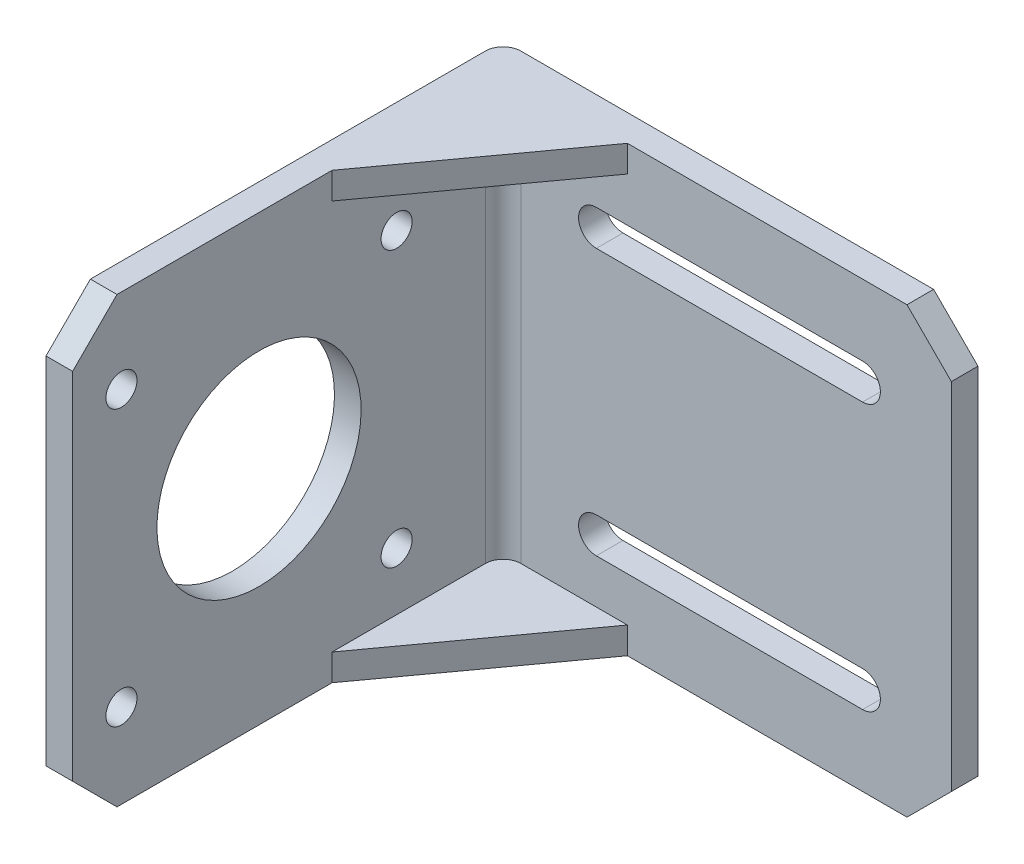
ISO-10303-21;
HEADER;
FILE_DESCRIPTION(('STEP AP214'),'2;1');
FILE_NAME('part.step','',(''),(''),'','','');
FILE_SCHEMA(('AUTOMOTIVE_DESIGN { 1 0 10303 214 1 1 1 1 }'));
ENDSEC;
DATA;
#1=APPLICATION_CONTEXT('core data for automotive mechanical design processes');
#2=APPLICATION_PROTOCOL_DEFINITION('international standard','automotive_design',2000,#1);
#3=PRODUCT_CONTEXT('',#1,'mechanical');
#4=PRODUCT('Part','Part','',(#3));
#5=PRODUCT_RELATED_PRODUCT_CATEGORY('part','',(#4));
#6=PRODUCT_DEFINITION_FORMATION('','',#4);
#7=PRODUCT_DEFINITION_CONTEXT('part definition',#1,'design');
#8=PRODUCT_DEFINITION('design','',#6,#7);
#9=PRODUCT_DEFINITION_SHAPE('','',#8);
#10=(LENGTH_UNIT() NAMED_UNIT(*) SI_UNIT(.MILLI.,.METRE.));
#11=(NAMED_UNIT(*) PLANE_ANGLE_UNIT() SI_UNIT($,.RADIAN.));
#12=(NAMED_UNIT(*) SI_UNIT($,.STERADIAN.) SOLID_ANGLE_UNIT());
#13=UNCERTAINTY_MEASURE_WITH_UNIT(LENGTH_MEASURE(1.E-05),#10,'distance_accuracy_value','');
#14=(GEOMETRIC_REPRESENTATION_CONTEXT(3) GLOBAL_UNCERTAINTY_ASSIGNED_CONTEXT((#13)) GLOBAL_UNIT_ASSIGNED_CONTEXT((#10,
#11,#12)) REPRESENTATION_CONTEXT('',''));
#15=CARTESIAN_POINT('',(0.,0.,0.));
#16=DIRECTION('',(0.,0.,1.));
#17=DIRECTION('',(1.,0.,0.));
#18=AXIS2_PLACEMENT_3D('',#15,#16,#17);
#19=CARTESIAN_POINT('',(-9.75000000000003,0.,3.));
#20=DIRECTION('',(0.809016994374951,0.,0.587785252292469));
#21=DIRECTION('',(0.,1.,0.));
#22=AXIS2_PLACEMENT_3D('',#19,#20,#21);
#23=PLANE('',#22);
#24=DIRECTION('',(0.,-1.,0.));
#25=VECTOR('',#24,1.);
#26=CARTESIAN_POINT('',(-9.75000000000003,-25.,3.));
#27=LINE('',#26,#25);
#28=CARTESIAN_POINT('',(-9.75000000000002,-22.,2.99999999999999));
#29=VERTEX_POINT('',#28);
#30=CARTESIAN_POINT('',(-9.75000000000001,-25.,3.));
#31=VERTEX_POINT('',#30);
#32=EDGE_CURVE('E333',#29,#31,#27,.T.);
#33=ORIENTED_EDGE('',*,*,#32,.F.);
#34=DIRECTION('',(0.587785252292469,0.,-0.809016994374951));
#35=VECTOR('',#34,1.);
#36=CARTESIAN_POINT('',(-9.75000000000003,-22.,3.));
#37=LINE('',#36,#35);
#38=CARTESIAN_POINT('',(-23.75,-22.,22.2693468865966));
#39=VERTEX_POINT('',#38);
#40=EDGE_CURVE('E349',#29,#39,#37,.F.);
#41=ORIENTED_EDGE('',*,*,#40,.T.);
#42=DIRECTION('',(0.,1.,0.));
#43=VECTOR('',#42,1.);
#44=CARTESIAN_POINT('',(-23.75,25.,22.2693468865966));
#45=LINE('',#44,#43);
#46=CARTESIAN_POINT('',(-23.75,-25.,22.2693468865966));
#47=VERTEX_POINT('',#46);
#48=EDGE_CURVE('E338',#47,#39,#45,.T.);
#49=ORIENTED_EDGE('',*,*,#48,.F.);
#50=DIRECTION('',(0.587785252292469,0.,-0.809016994374951));
#51=VECTOR('',#50,1.);
#52=CARTESIAN_POINT('',(-38.6864760679703,-25.,42.8276425021015));
#53=LINE('',#52,#51);
#54=EDGE_CURVE('E341',#31,#47,#53,.F.);
#55=ORIENTED_EDGE('',*,*,#54,.F.);
#56=EDGE_LOOP('',(#33,#41,#49,#55));
#57=FACE_BOUND('',#56,.T.);
#58=ADVANCED_FACE('F36',(#57),#23,.T.);
#59=CARTESIAN_POINT('',(26.75,25.,51.5));
#60=DIRECTION('',(-1.,0.,0.));
#61=DIRECTION('',(0.,-1.,0.));
#62=AXIS2_PLACEMENT_3D('',#59,#60,#61);
#63=PLANE('',#62);
#64=DIRECTION('',(0.,1.,0.));
#65=VECTOR('',#64,1.);
#66=CARTESIAN_POINT('',(26.75,25.,3.));
#67=LINE('',#66,#65);
#68=CARTESIAN_POINT('',(26.75,-20.,3.));
#69=VERTEX_POINT('',#68);
#70=CARTESIAN_POINT('',(26.75,20.,3.));
#71=VERTEX_POINT('',#70);
#72=EDGE_CURVE('E302',#69,#71,#67,.T.);
#73=ORIENTED_EDGE('',*,*,#72,.F.);
#74=DIRECTION('',(0.,0.,-1.));
#75=VECTOR('',#74,1.);
#76=CARTESIAN_POINT('',(26.75,-20.,51.5));
#77=LINE('',#76,#75);
#78=CARTESIAN_POINT('',(26.75,-20.,0.));
#79=VERTEX_POINT('',#78);
#80=EDGE_CURVE('E364',#69,#79,#77,.T.);
#81=ORIENTED_EDGE('',*,*,#80,.T.);
#82=DIRECTION('',(0.,1.,0.));
#83=VECTOR('',#82,1.);
#84=CARTESIAN_POINT('',(26.75,25.,0.));
#85=LINE('',#84,#83);
#86=CARTESIAN_POINT('',(26.75,20.,0.));
#87=VERTEX_POINT('',#86);
#88=EDGE_CURVE('E316',#79,#87,#85,.T.);
#89=ORIENTED_EDGE('',*,*,#88,.T.);
#90=DIRECTION('',(0.,0.,1.));
#91=VECTOR('',#90,1.);
#92=CARTESIAN_POINT('',(26.75,20.,51.5));
#93=LINE('',#92,#91);
#94=EDGE_CURVE('E352',#87,#71,#93,.T.);
#95=ORIENTED_EDGE('',*,*,#94,.T.);
#96=EDGE_LOOP('',(#73,#81,#89,#95));
#97=FACE_BOUND('',#96,.T.);
#98=ADVANCED_FACE('F444',(#97),#63,.F.);
#99=CARTESIAN_POINT('',(-26.75,25.,51.5));
#100=DIRECTION('',(0.,-1.,0.));
#101=DIRECTION('',(0.,0.,-1.));
#102=AXIS2_PLACEMENT_3D('',#99,#100,#101);
#103=PLANE('',#102);
#104=DIRECTION('',(-1.,0.,0.));
#105=VECTOR('',#104,1.);
#106=CARTESIAN_POINT('',(-26.75,25.,0.));
#107=LINE('',#106,#105);
#108=CARTESIAN_POINT('',(21.75,25.,0.));
#109=VERTEX_POINT('',#108);
#110=CARTESIAN_POINT('',(-24.75,25.,0.));
#111=VERTEX_POINT('',#110);
#112=EDGE_CURVE('E326',#109,#111,#107,.T.);
#113=ORIENTED_EDGE('',*,*,#112,.T.);
#114=CARTESIAN_POINT('',(-24.75,25.,2.));
#115=DIRECTION('',(0.,-1.,0.));
#116=DIRECTION('',(0.,0.,-1.));
#117=AXIS2_PLACEMENT_3D('',#114,#115,#116);
#118=CIRCLE('',#117,2.);
#119=CARTESIAN_POINT('',(-26.75,25.,2.));
#120=VERTEX_POINT('',#119);
#121=EDGE_CURVE('E11',#111,#120,#118,.F.);
#122=ORIENTED_EDGE('',*,*,#121,.T.);
#123=DIRECTION('',(0.,0.,-1.));
#124=VECTOR('',#123,1.);
#125=CARTESIAN_POINT('',(-26.75,25.,51.5));
#126=LINE('',#125,#124);
#127=CARTESIAN_POINT('',(-26.75,25.,46.5));
#128=VERTEX_POINT('',#127);
#129=EDGE_CURVE('E330',#128,#120,#126,.T.);
#130=ORIENTED_EDGE('',*,*,#129,.F.);
#131=DIRECTION('',(1.,0.,0.));
#132=VECTOR('',#131,1.);
#133=CARTESIAN_POINT('',(-23.75,25.,46.5));
#134=LINE('',#133,#132);
#135=CARTESIAN_POINT('',(-23.75,25.,46.5));
#136=VERTEX_POINT('',#135);
#137=EDGE_CURVE('E380',#128,#136,#134,.T.);
#138=ORIENTED_EDGE('',*,*,#137,.T.);
#139=DIRECTION('',(0.,0.,1.));
#140=VECTOR('',#139,1.);
#141=CARTESIAN_POINT('',(-23.75,25.,3.));
#142=LINE('',#141,#140);
#143=CARTESIAN_POINT('',(-23.75,25.,22.2693468865966));
#144=VERTEX_POINT('',#143);
#145=EDGE_CURVE('E310',#144,#136,#142,.T.);
#146=ORIENTED_EDGE('',*,*,#145,.F.);
#147=DIRECTION('',(-0.587785252292469,0.,0.809016994374951));
#148=VECTOR('',#147,1.);
#149=CARTESIAN_POINT('',(-38.6864760679703,25.,42.8276425021015));
#150=LINE('',#149,#148);
#151=CARTESIAN_POINT('',(-9.75000000000003,25.,3.));
#152=VERTEX_POINT('',#151);
#153=EDGE_CURVE('E343',#144,#152,#150,.F.);
#154=ORIENTED_EDGE('',*,*,#153,.T.);
#155=DIRECTION('',(-1.,0.,0.));
#156=VECTOR('',#155,1.);
#157=CARTESIAN_POINT('',(26.75,25.,3.));
#158=LINE('',#157,#156);
#159=CARTESIAN_POINT('',(21.75,25.,3.));
#160=VERTEX_POINT('',#159);
#161=EDGE_CURVE('E305',#160,#152,#158,.T.);
#162=ORIENTED_EDGE('',*,*,#161,.F.);
#163=DIRECTION('',(0.,0.,-1.));
#164=VECTOR('',#163,1.);
#165=CARTESIAN_POINT('',(21.75,25.,51.5));
#166=LINE('',#165,#164);
#167=EDGE_CURVE('E382',#160,#109,#166,.T.);
#168=ORIENTED_EDGE('',*,*,#167,.T.);
#169=EDGE_LOOP('',(#113,#122,#130,#138,#146,#154,#162,#168));
#170=FACE_BOUND('',#169,.T.);
#171=ADVANCED_FACE('F435',(#170),#103,.F.);
#172=CARTESIAN_POINT('',(-26.75,25.,51.5));
#173=DIRECTION('',(1.,0.,0.));
#174=DIRECTION('',(0.,1.,0.));
#175=AXIS2_PLACEMENT_3D('',#172,#173,#174);
#176=PLANE('',#175);
#177=CARTESIAN_POINT('',(-26.75,0.,30.5));
#178=DIRECTION('',(-1.,0.,0.));
#179=DIRECTION('',(0.,-1.,0.));
#180=AXIS2_PLACEMENT_3D('',#177,#178,#179);
#181=CIRCLE('',#180,11.5);
#182=CARTESIAN_POINT('',(-26.75,-11.5,30.5));
#183=VERTEX_POINT('',#182);
#184=EDGE_CURVE('E272',#183,#183,#181,.T.);
#185=ORIENTED_EDGE('',*,*,#184,.F.);
#186=EDGE_LOOP('',(#185));
#187=FACE_BOUND('',#186,.T.);
#188=CARTESIAN_POINT('',(-26.75,-15.5,15.));
#189=DIRECTION('',(-1.,0.,0.));
#190=DIRECTION('',(0.,-1.,0.));
#191=AXIS2_PLACEMENT_3D('',#188,#189,#190);
#192=CIRCLE('',#191,1.75);
#193=CARTESIAN_POINT('',(-26.75,-17.25,15.));
#194=VERTEX_POINT('',#193);
#195=EDGE_CURVE('E276',#194,#194,#192,.T.);
#196=ORIENTED_EDGE('',*,*,#195,.F.);
#197=EDGE_LOOP('',(#196));
#198=FACE_BOUND('',#197,.T.);
#199=CARTESIAN_POINT('',(-26.75,15.5,15.));
#200=DIRECTION('',(-1.,0.,0.));
#201=DIRECTION('',(0.,-1.,0.));
#202=AXIS2_PLACEMENT_3D('',#199,#200,#201);
#203=CIRCLE('',#202,1.75);
#204=CARTESIAN_POINT('',(-26.75,13.75,15.));
#205=VERTEX_POINT('',#204);
#206=EDGE_CURVE('E280',#205,#205,#203,.T.);
#207=ORIENTED_EDGE('',*,*,#206,.F.);
#208=EDGE_LOOP('',(#207));
#209=FACE_BOUND('',#208,.T.);
#210=CARTESIAN_POINT('',(-26.75,-15.5,46.));
#211=DIRECTION('',(-1.,0.,0.));
#212=DIRECTION('',(0.,-1.,0.));
#213=AXIS2_PLACEMENT_3D('',#210,#211,#212);
#214=CIRCLE('',#213,1.75);
#215=CARTESIAN_POINT('',(-26.75,-17.25,46.));
#216=VERTEX_POINT('',#215);
#217=EDGE_CURVE('E284',#216,#216,#214,.T.);
#218=ORIENTED_EDGE('',*,*,#217,.F.);
#219=EDGE_LOOP('',(#218));
#220=FACE_BOUND('',#219,.T.);
#221=CARTESIAN_POINT('',(-26.75,15.5,46.));
#222=DIRECTION('',(-1.,0.,0.));
#223=DIRECTION('',(0.,-1.,0.));
#224=AXIS2_PLACEMENT_3D('',#221,#222,#223);
#225=CIRCLE('',#224,1.75);
#226=CARTESIAN_POINT('',(-26.75,13.75,46.));
#227=VERTEX_POINT('',#226);
#228=EDGE_CURVE('E288',#227,#227,#225,.T.);
#229=ORIENTED_EDGE('',*,*,#228,.F.);
#230=EDGE_LOOP('',(#229));
#231=FACE_BOUND('',#230,.T.);
#232=ORIENTED_EDGE('',*,*,#129,.T.);
#233=DIRECTION('',(0.,-1.,0.));
#234=VECTOR('',#233,1.);
#235=CARTESIAN_POINT('',(-26.75,25.,2.));
#236=LINE('',#235,#234);
#237=CARTESIAN_POINT('',(-26.75,-25.,2.));
#238=VERTEX_POINT('',#237);
#239=EDGE_CURVE('E408',#120,#238,#236,.T.);
#240=ORIENTED_EDGE('',*,*,#239,.T.);
#241=DIRECTION('',(0.,0.,-1.));
#242=VECTOR('',#241,1.);
#243=CARTESIAN_POINT('',(-26.75,-25.,51.5));
#244=LINE('',#243,#242);
#245=CARTESIAN_POINT('',(-26.75,-25.,46.5));
#246=VERTEX_POINT('',#245);
#247=EDGE_CURVE('E322',#246,#238,#244,.T.);
#248=ORIENTED_EDGE('',*,*,#247,.F.);
#249=DIRECTION('',(0.,0.707106781186546,0.707106781186549));
#250=VECTOR('',#249,1.);
#251=CARTESIAN_POINT('',(-26.75,-20.,51.5));
#252=LINE('',#251,#250);
#253=CARTESIAN_POINT('',(-26.75,-20.,51.5));
#254=VERTEX_POINT('',#253);
#255=EDGE_CURVE('E391',#246,#254,#252,.T.);
#256=ORIENTED_EDGE('',*,*,#255,.T.);
#257=DIRECTION('',(0.,-1.,0.));
#258=VECTOR('',#257,1.);
#259=CARTESIAN_POINT('',(-26.75,25.,51.5));
#260=LINE('',#259,#258);
#261=CARTESIAN_POINT('',(-26.75,20.,51.5));
#262=VERTEX_POINT('',#261);
#263=EDGE_CURVE('E319',#262,#254,#260,.T.);
#264=ORIENTED_EDGE('',*,*,#263,.F.);
#265=DIRECTION('',(0.,0.707106781186546,-0.707106781186549));
#266=VECTOR('',#265,1.);
#267=CARTESIAN_POINT('',(-26.75,20.,51.5));
#268=LINE('',#267,#266);
#269=EDGE_CURVE('E393',#262,#128,#268,.T.);
#270=ORIENTED_EDGE('',*,*,#269,.T.);
#271=EDGE_LOOP('',(#232,#240,#248,#256,#264,#270));
#272=FACE_BOUND('',#271,.T.);
#273=ADVANCED_FACE('F414',(#187,#198,#209,#220,#231,#272),#176,.F.);
#274=CARTESIAN_POINT('',(-26.75,-25.,51.5));
#275=DIRECTION('',(0.,1.,0.));
#276=DIRECTION('',(0.,0.,1.));
#277=AXIS2_PLACEMENT_3D('',#274,#275,#276);
#278=PLANE('',#277);
#279=ORIENTED_EDGE('',*,*,#247,.T.);
#280=CARTESIAN_POINT('',(-24.75,-25.,2.));
#281=DIRECTION('',(0.,1.,0.));
#282=DIRECTION('',(0.,0.,1.));
#283=AXIS2_PLACEMENT_3D('',#280,#281,#282);
#284=CIRCLE('',#283,2.);
#285=CARTESIAN_POINT('',(-24.75,-25.,0.));
#286=VERTEX_POINT('',#285);
#287=EDGE_CURVE('E58',#238,#286,#284,.F.);
#288=ORIENTED_EDGE('',*,*,#287,.T.);
#289=DIRECTION('',(1.,0.,0.));
#290=VECTOR('',#289,1.);
#291=CARTESIAN_POINT('',(-26.75,-25.,0.));
#292=LINE('',#291,#290);
#293=CARTESIAN_POINT('',(21.7499999999999,-25.,0.));
#294=VERTEX_POINT('',#293);
#295=EDGE_CURVE('E323',#286,#294,#292,.T.);
#296=ORIENTED_EDGE('',*,*,#295,.T.);
#297=DIRECTION('',(0.,0.,1.));
#298=VECTOR('',#297,1.);
#299=CARTESIAN_POINT('',(21.7499999999999,-25.,51.5));
#300=LINE('',#299,#298);
#301=CARTESIAN_POINT('',(21.7499999999999,-25.,3.));
#302=VERTEX_POINT('',#301);
#303=EDGE_CURVE('E374',#294,#302,#300,.T.);
#304=ORIENTED_EDGE('',*,*,#303,.T.);
#305=DIRECTION('',(1.,0.,0.));
#306=VECTOR('',#305,1.);
#307=CARTESIAN_POINT('',(26.75,-25.,3.));
#308=LINE('',#307,#306);
#309=EDGE_CURVE('E307',#31,#302,#308,.T.);
#310=ORIENTED_EDGE('',*,*,#309,.F.);
#311=ORIENTED_EDGE('',*,*,#54,.T.);
#312=DIRECTION('',(0.,0.,1.));
#313=VECTOR('',#312,1.);
#314=CARTESIAN_POINT('',(-23.75,-25.,3.));
#315=LINE('',#314,#313);
#316=CARTESIAN_POINT('',(-23.75,-25.,46.4999999999999));
#317=VERTEX_POINT('',#316);
#318=EDGE_CURVE('E313',#47,#317,#315,.T.);
#319=ORIENTED_EDGE('',*,*,#318,.T.);
#320=DIRECTION('',(-1.,0.,0.));
#321=VECTOR('',#320,1.);
#322=CARTESIAN_POINT('',(-26.75,-25.,46.5));
#323=LINE('',#322,#321);
#324=EDGE_CURVE('E372',#317,#246,#323,.T.);
#325=ORIENTED_EDGE('',*,*,#324,.T.);
#326=EDGE_LOOP('',(#279,#288,#296,#304,#310,#311,#319,#325));
#327=FACE_BOUND('',#326,.T.);
#328=ADVANCED_FACE('F419',(#327),#278,.F.);
#329=CARTESIAN_POINT('',(0.,0.,51.5));
#330=DIRECTION('',(0.,0.,1.));
#331=DIRECTION('',(1.,0.,0.));
#332=AXIS2_PLACEMENT_3D('',#329,#330,#331);
#333=PLANE('',#332);
#334=DIRECTION('',(0.,-1.,0.));
#335=VECTOR('',#334,1.);
#336=CARTESIAN_POINT('',(-23.75,25.,51.5));
#337=LINE('',#336,#335);
#338=CARTESIAN_POINT('',(-23.75,20.,51.5));
#339=VERTEX_POINT('',#338);
#340=CARTESIAN_POINT('',(-23.75,-20.,51.5));
#341=VERTEX_POINT('',#340);
#342=EDGE_CURVE('E300',#339,#341,#337,.T.);
#343=ORIENTED_EDGE('',*,*,#342,.F.);
#344=DIRECTION('',(-1.,0.,0.));
#345=VECTOR('',#344,1.);
#346=CARTESIAN_POINT('',(-26.75,20.,51.5));
#347=LINE('',#346,#345);
#348=EDGE_CURVE('E388',#339,#262,#347,.T.);
#349=ORIENTED_EDGE('',*,*,#348,.T.);
#350=ORIENTED_EDGE('',*,*,#263,.T.);
#351=DIRECTION('',(1.,0.,0.));
#352=VECTOR('',#351,1.);
#353=CARTESIAN_POINT('',(-23.75,-20.,51.5));
#354=LINE('',#353,#352);
#355=EDGE_CURVE('E385',#254,#341,#354,.T.);
#356=ORIENTED_EDGE('',*,*,#355,.T.);
#357=EDGE_LOOP('',(#343,#349,#350,#356));
#358=FACE_BOUND('',#357,.T.);
#359=ADVANCED_FACE('F428',(#358),#333,.T.);
#360=CARTESIAN_POINT('',(0.,0.,0.));
#361=DIRECTION('',(0.,0.,1.));
#362=DIRECTION('',(1.,0.,0.));
#363=AXIS2_PLACEMENT_3D('',#360,#361,#362);
#364=PLANE('',#363);
#365=DIRECTION('',(-1.,0.,0.));
#366=VECTOR('',#365,1.);
#367=CARTESIAN_POINT('',(0.,-13.,0.));
#368=LINE('',#367,#366);
#369=CARTESIAN_POINT('',(16.75,-13.,0.));
#370=VERTEX_POINT('',#369);
#371=CARTESIAN_POINT('',(-13.25,-13.,0.));
#372=VERTEX_POINT('',#371);
#373=EDGE_CURVE('E234',#370,#372,#368,.T.);
#374=ORIENTED_EDGE('',*,*,#373,.T.);
#375=CARTESIAN_POINT('',(-13.25,-15.,0.));
#376=DIRECTION('',(0.,0.,1.));
#377=DIRECTION('',(1.,0.,0.));
#378=AXIS2_PLACEMENT_3D('',#375,#376,#377);
#379=CIRCLE('',#378,2.);
#380=CARTESIAN_POINT('',(-13.25,-17.,0.));
#381=VERTEX_POINT('',#380);
#382=EDGE_CURVE('E237',#372,#381,#379,.T.);
#383=ORIENTED_EDGE('',*,*,#382,.T.);
#384=DIRECTION('',(1.,0.,0.));
#385=VECTOR('',#384,1.);
#386=CARTESIAN_POINT('',(0.,-17.,0.));
#387=LINE('',#386,#385);
#388=CARTESIAN_POINT('',(16.75,-17.,0.));
#389=VERTEX_POINT('',#388);
#390=EDGE_CURVE('E229',#381,#389,#387,.T.);
#391=ORIENTED_EDGE('',*,*,#390,.T.);
#392=CARTESIAN_POINT('',(16.75,-15.,0.));
#393=DIRECTION('',(0.,0.,1.));
#394=DIRECTION('',(1.,0.,0.));
#395=AXIS2_PLACEMENT_3D('',#392,#393,#394);
#396=CIRCLE('',#395,2.);
#397=EDGE_CURVE('E204',#389,#370,#396,.T.);
#398=ORIENTED_EDGE('',*,*,#397,.T.);
#399=EDGE_LOOP('',(#374,#383,#391,#398));
#400=FACE_BOUND('',#399,.T.);
#401=DIRECTION('',(-1.,0.,0.));
#402=VECTOR('',#401,1.);
#403=CARTESIAN_POINT('',(0.,17.,0.));
#404=LINE('',#403,#402);
#405=CARTESIAN_POINT('',(16.75,17.,0.));
#406=VERTEX_POINT('',#405);
#407=CARTESIAN_POINT('',(-13.25,17.,0.));
#408=VERTEX_POINT('',#407);
#409=EDGE_CURVE('E266',#406,#408,#404,.T.);
#410=ORIENTED_EDGE('',*,*,#409,.T.);
#411=CARTESIAN_POINT('',(-13.25,15.,0.));
#412=DIRECTION('',(0.,0.,1.));
#413=DIRECTION('',(1.,0.,0.));
#414=AXIS2_PLACEMENT_3D('',#411,#412,#413);
#415=CIRCLE('',#414,2.);
#416=CARTESIAN_POINT('',(-13.25,13.,0.));
#417=VERTEX_POINT('',#416);
#418=EDGE_CURVE('E269',#408,#417,#415,.T.);
#419=ORIENTED_EDGE('',*,*,#418,.T.);
#420=DIRECTION('',(1.,0.,0.));
#421=VECTOR('',#420,1.);
#422=CARTESIAN_POINT('',(0.,13.,0.));
#423=LINE('',#422,#421);
#424=CARTESIAN_POINT('',(16.75,13.,0.));
#425=VERTEX_POINT('',#424);
#426=EDGE_CURVE('E254',#417,#425,#423,.T.);
#427=ORIENTED_EDGE('',*,*,#426,.T.);
#428=CARTESIAN_POINT('',(16.75,15.,0.));
#429=DIRECTION('',(0.,0.,1.));
#430=DIRECTION('',(1.,0.,0.));
#431=AXIS2_PLACEMENT_3D('',#428,#429,#430);
#432=CIRCLE('',#431,2.);
#433=EDGE_CURVE('E263',#425,#406,#432,.T.);
#434=ORIENTED_EDGE('',*,*,#433,.T.);
#435=EDGE_LOOP('',(#410,#419,#427,#434));
#436=FACE_BOUND('',#435,.T.);
#437=ORIENTED_EDGE('',*,*,#295,.F.);
#438=DIRECTION('',(0.,-1.,0.));
#439=VECTOR('',#438,1.);
#440=CARTESIAN_POINT('',(-24.75,0.,0.));
#441=LINE('',#440,#439);
#442=EDGE_CURVE('E44',#286,#111,#441,.F.);
#443=ORIENTED_EDGE('',*,*,#442,.T.);
#444=ORIENTED_EDGE('',*,*,#112,.F.);
#445=DIRECTION('',(-0.707106781186546,0.707106781186549,0.));
#446=VECTOR('',#445,1.);
#447=CARTESIAN_POINT('',(21.75,25.,0.));
#448=LINE('',#447,#446);
#449=EDGE_CURVE('E367',#109,#87,#448,.F.);
#450=ORIENTED_EDGE('',*,*,#449,.T.);
#451=ORIENTED_EDGE('',*,*,#88,.F.);
#452=DIRECTION('',(0.707106781186549,0.707106781186546,0.));
#453=VECTOR('',#452,1.);
#454=CARTESIAN_POINT('',(26.75,-20.,0.));
#455=LINE('',#454,#453);
#456=EDGE_CURVE('E369',#79,#294,#455,.F.);
#457=ORIENTED_EDGE('',*,*,#456,.T.);
#458=EDGE_LOOP('',(#437,#443,#444,#450,#451,#457));
#459=FACE_BOUND('',#458,.T.);
#460=ADVANCED_FACE('F483',(#400,#436,#459),#364,.F.);
#461=CARTESIAN_POINT('',(-23.75,25.,3.));
#462=DIRECTION('',(-1.,0.,0.));
#463=DIRECTION('',(0.,-1.,0.));
#464=AXIS2_PLACEMENT_3D('',#461,#462,#463);
#465=PLANE('',#464);
#466=CARTESIAN_POINT('',(-23.75,0.,30.5));
#467=DIRECTION('',(-1.,0.,0.));
#468=DIRECTION('',(0.,-1.,0.));
#469=AXIS2_PLACEMENT_3D('',#466,#467,#468);
#470=CIRCLE('',#469,11.5);
#471=CARTESIAN_POINT('',(-23.75,-11.5,30.5));
#472=VERTEX_POINT('',#471);
#473=EDGE_CURVE('E275',#472,#472,#470,.T.);
#474=ORIENTED_EDGE('',*,*,#473,.T.);
#475=EDGE_LOOP('',(#474));
#476=FACE_BOUND('',#475,.T.);
#477=CARTESIAN_POINT('',(-23.75,-15.5,15.));
#478=DIRECTION('',(-1.,0.,0.));
#479=DIRECTION('',(0.,-1.,0.));
#480=AXIS2_PLACEMENT_3D('',#477,#478,#479);
#481=CIRCLE('',#480,1.75);
#482=CARTESIAN_POINT('',(-23.75,-17.25,15.));
#483=VERTEX_POINT('',#482);
#484=EDGE_CURVE('E279',#483,#483,#481,.T.);
#485=ORIENTED_EDGE('',*,*,#484,.T.);
#486=EDGE_LOOP('',(#485));
#487=FACE_BOUND('',#486,.T.);
#488=CARTESIAN_POINT('',(-23.75,15.5,15.));
#489=DIRECTION('',(-1.,0.,0.));
#490=DIRECTION('',(0.,-1.,0.));
#491=AXIS2_PLACEMENT_3D('',#488,#489,#490);
#492=CIRCLE('',#491,1.75);
#493=CARTESIAN_POINT('',(-23.75,13.75,15.));
#494=VERTEX_POINT('',#493);
#495=EDGE_CURVE('E283',#494,#494,#492,.T.);
#496=ORIENTED_EDGE('',*,*,#495,.T.);
#497=EDGE_LOOP('',(#496));
#498=FACE_BOUND('',#497,.T.);
#499=CARTESIAN_POINT('',(-23.75,-15.5,46.));
#500=DIRECTION('',(-1.,0.,0.));
#501=DIRECTION('',(0.,-1.,0.));
#502=AXIS2_PLACEMENT_3D('',#499,#500,#501);
#503=CIRCLE('',#502,1.75);
#504=CARTESIAN_POINT('',(-23.75,-17.25,46.));
#505=VERTEX_POINT('',#504);
#506=EDGE_CURVE('E287',#505,#505,#503,.T.);
#507=ORIENTED_EDGE('',*,*,#506,.T.);
#508=EDGE_LOOP('',(#507));
#509=FACE_BOUND('',#508,.T.);
#510=CARTESIAN_POINT('',(-23.75,15.5,46.));
#511=DIRECTION('',(-1.,0.,0.));
#512=DIRECTION('',(0.,-1.,0.));
#513=AXIS2_PLACEMENT_3D('',#510,#511,#512);
#514=CIRCLE('',#513,1.75);
#515=CARTESIAN_POINT('',(-23.75,13.75,46.));
#516=VERTEX_POINT('',#515);
#517=EDGE_CURVE('E291',#516,#516,#514,.T.);
#518=ORIENTED_EDGE('',*,*,#517,.T.);
#519=EDGE_LOOP('',(#518));
#520=FACE_BOUND('',#519,.T.);
#521=DIRECTION('',(0.,0.,-1.));
#522=VECTOR('',#521,1.);
#523=CARTESIAN_POINT('',(-23.75,-22.,2.99999999999999));
#524=LINE('',#523,#522);
#525=CARTESIAN_POINT('',(-23.75,-22.,5.));
#526=VERTEX_POINT('',#525);
#527=EDGE_CURVE('E294',#39,#526,#524,.T.);
#528=ORIENTED_EDGE('',*,*,#527,.T.);
#529=DIRECTION('',(0.,1.,0.));
#530=VECTOR('',#529,1.);
#531=CARTESIAN_POINT('',(-23.75,22.,5.));
#532=LINE('',#531,#530);
#533=CARTESIAN_POINT('',(-23.75,22.,4.99999999999999));
#534=VERTEX_POINT('',#533);
#535=EDGE_CURVE('E399',#526,#534,#532,.T.);
#536=ORIENTED_EDGE('',*,*,#535,.T.);
#537=DIRECTION('',(0.,0.,1.));
#538=VECTOR('',#537,1.);
#539=CARTESIAN_POINT('',(-23.75,22.,3.));
#540=LINE('',#539,#538);
#541=CARTESIAN_POINT('',(-23.75,22.,22.2693468865966));
#542=VERTEX_POINT('',#541);
#543=EDGE_CURVE('E292',#534,#542,#540,.T.);
#544=ORIENTED_EDGE('',*,*,#543,.T.);
#545=EDGE_CURVE('E337',#542,#144,#45,.T.);
#546=ORIENTED_EDGE('',*,*,#545,.T.);
#547=ORIENTED_EDGE('',*,*,#145,.T.);
#548=DIRECTION('',(0.,-0.707106781186546,0.707106781186549));
#549=VECTOR('',#548,1.);
#550=CARTESIAN_POINT('',(-23.75,20.,51.5));
#551=LINE('',#550,#549);
#552=EDGE_CURVE('E397',#136,#339,#551,.T.);
#553=ORIENTED_EDGE('',*,*,#552,.T.);
#554=ORIENTED_EDGE('',*,*,#342,.T.);
#555=DIRECTION('',(0.,-0.707106781186546,-0.707106781186549));
#556=VECTOR('',#555,1.);
#557=CARTESIAN_POINT('',(-23.75,-20.,51.5));
#558=LINE('',#557,#556);
#559=EDGE_CURVE('E395',#341,#317,#558,.T.);
#560=ORIENTED_EDGE('',*,*,#559,.T.);
#561=ORIENTED_EDGE('',*,*,#318,.F.);
#562=ORIENTED_EDGE('',*,*,#48,.T.);
#563=EDGE_LOOP('',(#528,#536,#544,#546,#547,#553,#554,#560,#561,#562));
#564=FACE_BOUND('',#563,.T.);
#565=ADVANCED_FACE('F465',(#476,#487,#498,#509,#520,#564),#465,.F.);
#566=CARTESIAN_POINT('',(0.,0.,3.));
#567=DIRECTION('',(0.,0.,-1.));
#568=DIRECTION('',(-1.,0.,0.));
#569=AXIS2_PLACEMENT_3D('',#566,#567,#568);
#570=PLANE('',#569);
#571=DIRECTION('',(1.,0.,0.));
#572=VECTOR('',#571,1.);
#573=CARTESIAN_POINT('',(-13.25,-17.,3.));
#574=LINE('',#573,#572);
#575=CARTESIAN_POINT('',(-13.25,-17.,3.));
#576=VERTEX_POINT('',#575);
#577=CARTESIAN_POINT('',(16.75,-17.,3.));
#578=VERTEX_POINT('',#577);
#579=EDGE_CURVE('E212',#576,#578,#574,.T.);
#580=ORIENTED_EDGE('',*,*,#579,.F.);
#581=CARTESIAN_POINT('',(-13.25,-15.,3.));
#582=DIRECTION('',(0.,0.,1.));
#583=DIRECTION('',(1.,0.,0.));
#584=AXIS2_PLACEMENT_3D('',#581,#582,#583);
#585=CIRCLE('',#584,2.);
#586=CARTESIAN_POINT('',(-13.25,-13.,3.));
#587=VERTEX_POINT('',#586);
#588=EDGE_CURVE('E217',#587,#576,#585,.T.);
#589=ORIENTED_EDGE('',*,*,#588,.F.);
#590=DIRECTION('',(-1.,0.,0.));
#591=VECTOR('',#590,1.);
#592=CARTESIAN_POINT('',(-13.25,-13.,3.));
#593=LINE('',#592,#591);
#594=CARTESIAN_POINT('',(16.75,-13.,3.));
#595=VERTEX_POINT('',#594);
#596=EDGE_CURVE('E222',#595,#587,#593,.T.);
#597=ORIENTED_EDGE('',*,*,#596,.F.);
#598=CARTESIAN_POINT('',(16.75,-15.,3.));
#599=DIRECTION('',(0.,0.,1.));
#600=DIRECTION('',(1.,0.,0.));
#601=AXIS2_PLACEMENT_3D('',#598,#599,#600);
#602=CIRCLE('',#601,2.);
#603=EDGE_CURVE('E201',#578,#595,#602,.T.);
#604=ORIENTED_EDGE('',*,*,#603,.F.);
#605=EDGE_LOOP('',(#580,#589,#597,#604));
#606=FACE_BOUND('',#605,.T.);
#607=DIRECTION('',(1.,0.,0.));
#608=VECTOR('',#607,1.);
#609=CARTESIAN_POINT('',(-13.25,13.,3.));
#610=LINE('',#609,#608);
#611=CARTESIAN_POINT('',(-13.25,13.,3.));
#612=VERTEX_POINT('',#611);
#613=CARTESIAN_POINT('',(16.75,13.,3.));
#614=VERTEX_POINT('',#613);
#615=EDGE_CURVE('E242',#612,#614,#610,.T.);
#616=ORIENTED_EDGE('',*,*,#615,.F.);
#617=CARTESIAN_POINT('',(-13.25,15.,3.));
#618=DIRECTION('',(0.,0.,1.));
#619=DIRECTION('',(1.,0.,0.));
#620=AXIS2_PLACEMENT_3D('',#617,#618,#619);
#621=CIRCLE('',#620,2.);
#622=CARTESIAN_POINT('',(-13.25,17.,3.));
#623=VERTEX_POINT('',#622);
#624=EDGE_CURVE('E240',#623,#612,#621,.T.);
#625=ORIENTED_EDGE('',*,*,#624,.F.);
#626=DIRECTION('',(-1.,0.,0.));
#627=VECTOR('',#626,1.);
#628=CARTESIAN_POINT('',(-13.25,17.,3.));
#629=LINE('',#628,#627);
#630=CARTESIAN_POINT('',(16.75,17.,3.));
#631=VERTEX_POINT('',#630);
#632=EDGE_CURVE('E248',#631,#623,#629,.T.);
#633=ORIENTED_EDGE('',*,*,#632,.F.);
#634=CARTESIAN_POINT('',(16.75,15.,3.));
#635=DIRECTION('',(0.,0.,1.));
#636=DIRECTION('',(1.,0.,0.));
#637=AXIS2_PLACEMENT_3D('',#634,#635,#636);
#638=CIRCLE('',#637,2.);
#639=EDGE_CURVE('E245',#614,#631,#638,.T.);
#640=ORIENTED_EDGE('',*,*,#639,.F.);
#641=EDGE_LOOP('',(#616,#625,#633,#640));
#642=FACE_BOUND('',#641,.T.);
#643=DIRECTION('',(1.,0.,0.));
#644=VECTOR('',#643,1.);
#645=CARTESIAN_POINT('',(-23.75,22.,3.));
#646=LINE('',#645,#644);
#647=CARTESIAN_POINT('',(-21.75,22.,3.));
#648=VERTEX_POINT('',#647);
#649=CARTESIAN_POINT('',(-9.75000000000004,22.,3.));
#650=VERTEX_POINT('',#649);
#651=EDGE_CURVE('E297',#648,#650,#646,.T.);
#652=ORIENTED_EDGE('',*,*,#651,.F.);
#653=DIRECTION('',(0.,1.,0.));
#654=VECTOR('',#653,1.);
#655=CARTESIAN_POINT('',(-21.75,-22.,3.));
#656=LINE('',#655,#654);
#657=CARTESIAN_POINT('',(-21.75,-22.,2.99999999999999));
#658=VERTEX_POINT('',#657);
#659=EDGE_CURVE('E404',#648,#658,#656,.F.);
#660=ORIENTED_EDGE('',*,*,#659,.T.);
#661=DIRECTION('',(1.,0.,0.));
#662=VECTOR('',#661,1.);
#663=CARTESIAN_POINT('',(-23.75,-22.,2.99999999999999));
#664=LINE('',#663,#662);
#665=EDGE_CURVE('E298',#658,#29,#664,.T.);
#666=ORIENTED_EDGE('',*,*,#665,.T.);
#667=ORIENTED_EDGE('',*,*,#32,.T.);
#668=ORIENTED_EDGE('',*,*,#309,.T.);
#669=DIRECTION('',(-0.707106781186549,-0.707106781186546,0.));
#670=VECTOR('',#669,1.);
#671=CARTESIAN_POINT('',(26.75,-20.,3.));
#672=LINE('',#671,#670);
#673=EDGE_CURVE('E378',#302,#69,#672,.F.);
#674=ORIENTED_EDGE('',*,*,#673,.T.);
#675=ORIENTED_EDGE('',*,*,#72,.T.);
#676=DIRECTION('',(0.707106781186546,-0.707106781186549,0.));
#677=VECTOR('',#676,1.);
#678=CARTESIAN_POINT('',(21.75,25.,3.));
#679=LINE('',#678,#677);
#680=EDGE_CURVE('E376',#71,#160,#679,.F.);
#681=ORIENTED_EDGE('',*,*,#680,.T.);
#682=ORIENTED_EDGE('',*,*,#161,.T.);
#683=EDGE_CURVE('E334',#152,#650,#27,.T.);
#684=ORIENTED_EDGE('',*,*,#683,.T.);
#685=EDGE_LOOP('',(#652,#660,#666,#667,#668,#674,#675,#681,#682,#684));
#686=FACE_BOUND('',#685,.T.);
#687=ADVANCED_FACE('F219',(#606,#642,#686),#570,.F.);
#688=ORIENTED_EDGE('',*,*,#545,.F.);
#689=DIRECTION('',(-0.587785252292469,0.,0.809016994374951));
#690=VECTOR('',#689,1.);
#691=CARTESIAN_POINT('',(-9.75000000000003,22.,3.));
#692=LINE('',#691,#690);
#693=EDGE_CURVE('E346',#542,#650,#692,.F.);
#694=ORIENTED_EDGE('',*,*,#693,.T.);
#695=ORIENTED_EDGE('',*,*,#683,.F.);
#696=ORIENTED_EDGE('',*,*,#153,.F.);
#697=EDGE_LOOP('',(#688,#694,#695,#696));
#698=FACE_BOUND('',#697,.T.);
#699=ADVANCED_FACE('F447',(#698),#23,.T.);
#700=CARTESIAN_POINT('',(-23.75,-22.,2.99999999999999));
#701=DIRECTION('',(0.,-1.,0.));
#702=DIRECTION('',(0.,0.,-1.));
#703=AXIS2_PLACEMENT_3D('',#700,#701,#702);
#704=PLANE('',#703);
#705=ORIENTED_EDGE('',*,*,#665,.F.);
#706=CARTESIAN_POINT('',(-21.75,-22.,5.));
#707=DIRECTION('',(0.,-1.,0.));
#708=DIRECTION('',(0.,0.,-1.));
#709=AXIS2_PLACEMENT_3D('',#706,#707,#708);
#710=CIRCLE('',#709,2.);
#711=EDGE_CURVE('E406',#658,#526,#710,.F.);
#712=ORIENTED_EDGE('',*,*,#711,.T.);
#713=ORIENTED_EDGE('',*,*,#527,.F.);
#714=ORIENTED_EDGE('',*,*,#40,.F.);
#715=EDGE_LOOP('',(#705,#712,#713,#714));
#716=FACE_BOUND('',#715,.T.);
#717=ADVANCED_FACE('F456',(#716),#704,.F.);
#718=CARTESIAN_POINT('',(-23.75,22.,3.));
#719=DIRECTION('',(0.,1.,0.));
#720=DIRECTION('',(0.,0.,1.));
#721=AXIS2_PLACEMENT_3D('',#718,#719,#720);
#722=PLANE('',#721);
#723=ORIENTED_EDGE('',*,*,#543,.F.);
#724=CARTESIAN_POINT('',(-21.75,22.,5.));
#725=DIRECTION('',(0.,1.,0.));
#726=DIRECTION('',(0.,0.,1.));
#727=AXIS2_PLACEMENT_3D('',#724,#725,#726);
#728=CIRCLE('',#727,2.);
#729=EDGE_CURVE('E402',#534,#648,#728,.F.);
#730=ORIENTED_EDGE('',*,*,#729,.T.);
#731=ORIENTED_EDGE('',*,*,#651,.T.);
#732=ORIENTED_EDGE('',*,*,#693,.F.);
#733=EDGE_LOOP('',(#723,#730,#731,#732));
#734=FACE_BOUND('',#733,.T.);
#735=ADVANCED_FACE('F462',(#734),#722,.F.);
#736=CARTESIAN_POINT('',(-16.75,15.5,46.));
#737=DIRECTION('',(-1.,0.,0.));
#738=DIRECTION('',(0.,-1.,0.));
#739=AXIS2_PLACEMENT_3D('',#736,#737,#738);
#740=CYLINDRICAL_SURFACE('',#739,1.75);
#741=ORIENTED_EDGE('',*,*,#228,.T.);
#742=EDGE_LOOP('',(#741));
#743=FACE_BOUND('',#742,.T.);
#744=ORIENTED_EDGE('',*,*,#517,.F.);
#745=EDGE_LOOP('',(#744));
#746=FACE_BOUND('',#745,.T.);
#747=ADVANCED_FACE('F499',(#743,#746),#740,.F.);
#748=CARTESIAN_POINT('',(-16.75,-15.5,46.));
#749=DIRECTION('',(-1.,0.,0.));
#750=DIRECTION('',(0.,-1.,0.));
#751=AXIS2_PLACEMENT_3D('',#748,#749,#750);
#752=CYLINDRICAL_SURFACE('',#751,1.75);
#753=ORIENTED_EDGE('',*,*,#217,.T.);
#754=EDGE_LOOP('',(#753));
#755=FACE_BOUND('',#754,.T.);
#756=ORIENTED_EDGE('',*,*,#506,.F.);
#757=EDGE_LOOP('',(#756));
#758=FACE_BOUND('',#757,.T.);
#759=ADVANCED_FACE('F504',(#755,#758),#752,.F.);
#760=CARTESIAN_POINT('',(-16.75,15.5,15.));
#761=DIRECTION('',(-1.,0.,0.));
#762=DIRECTION('',(0.,-1.,0.));
#763=AXIS2_PLACEMENT_3D('',#760,#761,#762);
#764=CYLINDRICAL_SURFACE('',#763,1.75);
#765=ORIENTED_EDGE('',*,*,#206,.T.);
#766=EDGE_LOOP('',(#765));
#767=FACE_BOUND('',#766,.T.);
#768=ORIENTED_EDGE('',*,*,#495,.F.);
#769=EDGE_LOOP('',(#768));
#770=FACE_BOUND('',#769,.T.);
#771=ADVANCED_FACE('F672',(#767,#770),#764,.F.);
#772=CARTESIAN_POINT('',(-16.75,-15.5,15.));
#773=DIRECTION('',(-1.,0.,0.));
#774=DIRECTION('',(0.,-1.,0.));
#775=AXIS2_PLACEMENT_3D('',#772,#773,#774);
#776=CYLINDRICAL_SURFACE('',#775,1.75);
#777=ORIENTED_EDGE('',*,*,#195,.T.);
#778=EDGE_LOOP('',(#777));
#779=FACE_BOUND('',#778,.T.);
#780=ORIENTED_EDGE('',*,*,#484,.F.);
#781=EDGE_LOOP('',(#780));
#782=FACE_BOUND('',#781,.T.);
#783=ADVANCED_FACE('F664',(#779,#782),#776,.F.);
#784=CARTESIAN_POINT('',(-16.75,0.,30.5));
#785=DIRECTION('',(-1.,0.,0.));
#786=DIRECTION('',(0.,-1.,0.));
#787=AXIS2_PLACEMENT_3D('',#784,#785,#786);
#788=CYLINDRICAL_SURFACE('',#787,11.5);
#789=ORIENTED_EDGE('',*,*,#184,.T.);
#790=EDGE_LOOP('',(#789));
#791=FACE_BOUND('',#790,.T.);
#792=ORIENTED_EDGE('',*,*,#473,.F.);
#793=EDGE_LOOP('',(#792));
#794=FACE_BOUND('',#793,.T.);
#795=ADVANCED_FACE('F656',(#791,#794),#788,.F.);
#796=CARTESIAN_POINT('',(-13.25,15.,-7.));
#797=DIRECTION('',(0.,0.,1.));
#798=DIRECTION('',(1.,0.,0.));
#799=AXIS2_PLACEMENT_3D('',#796,#797,#798);
#800=CYLINDRICAL_SURFACE('',#799,2.);
#801=DIRECTION('',(0.,0.,1.));
#802=VECTOR('',#801,1.);
#803=CARTESIAN_POINT('',(-13.25,17.,-7.));
#804=LINE('',#803,#802);
#805=EDGE_CURVE('E252',#408,#623,#804,.T.);
#806=ORIENTED_EDGE('',*,*,#805,.T.);
#807=ORIENTED_EDGE('',*,*,#624,.T.);
#808=DIRECTION('',(0.,0.,1.));
#809=VECTOR('',#808,1.);
#810=CARTESIAN_POINT('',(-13.25,13.,-7.));
#811=LINE('',#810,#809);
#812=EDGE_CURVE('E251',#417,#612,#811,.T.);
#813=ORIENTED_EDGE('',*,*,#812,.F.);
#814=ORIENTED_EDGE('',*,*,#418,.F.);
#815=EDGE_LOOP('',(#806,#807,#813,#814));
#816=FACE_BOUND('',#815,.T.);
#817=ADVANCED_FACE('F648',(#816),#800,.F.);
#818=CARTESIAN_POINT('',(-13.25,17.,-7.));
#819=DIRECTION('',(0.,1.,0.));
#820=DIRECTION('',(0.,0.,1.));
#821=AXIS2_PLACEMENT_3D('',#818,#819,#820);
#822=PLANE('',#821);
#823=DIRECTION('',(0.,0.,1.));
#824=VECTOR('',#823,1.);
#825=CARTESIAN_POINT('',(16.75,17.,-7.));
#826=LINE('',#825,#824);
#827=EDGE_CURVE('E255',#406,#631,#826,.T.);
#828=ORIENTED_EDGE('',*,*,#827,.T.);
#829=ORIENTED_EDGE('',*,*,#632,.T.);
#830=ORIENTED_EDGE('',*,*,#805,.F.);
#831=ORIENTED_EDGE('',*,*,#409,.F.);
#832=EDGE_LOOP('',(#828,#829,#830,#831));
#833=FACE_BOUND('',#832,.T.);
#834=ADVANCED_FACE('F640',(#833),#822,.F.);
#835=CARTESIAN_POINT('',(16.75,15.,-7.));
#836=DIRECTION('',(0.,0.,1.));
#837=DIRECTION('',(1.,0.,0.));
#838=AXIS2_PLACEMENT_3D('',#835,#836,#837);
#839=CYLINDRICAL_SURFACE('',#838,2.);
#840=DIRECTION('',(0.,0.,1.));
#841=VECTOR('',#840,1.);
#842=CARTESIAN_POINT('',(16.75,13.,-7.));
#843=LINE('',#842,#841);
#844=EDGE_CURVE('E257',#425,#614,#843,.T.);
#845=ORIENTED_EDGE('',*,*,#844,.T.);
#846=ORIENTED_EDGE('',*,*,#639,.T.);
#847=ORIENTED_EDGE('',*,*,#827,.F.);
#848=ORIENTED_EDGE('',*,*,#433,.F.);
#849=EDGE_LOOP('',(#845,#846,#847,#848));
#850=FACE_BOUND('',#849,.T.);
#851=ADVANCED_FACE('F632',(#850),#839,.F.);
#852=CARTESIAN_POINT('',(-13.25,13.,-7.));
#853=DIRECTION('',(0.,-1.,0.));
#854=DIRECTION('',(0.,0.,-1.));
#855=AXIS2_PLACEMENT_3D('',#852,#853,#854);
#856=PLANE('',#855);
#857=ORIENTED_EDGE('',*,*,#812,.T.);
#858=ORIENTED_EDGE('',*,*,#615,.T.);
#859=ORIENTED_EDGE('',*,*,#844,.F.);
#860=ORIENTED_EDGE('',*,*,#426,.F.);
#861=EDGE_LOOP('',(#857,#858,#859,#860));
#862=FACE_BOUND('',#861,.T.);
#863=ADVANCED_FACE('F624',(#862),#856,.F.);
#864=CARTESIAN_POINT('',(-13.25,-15.,-7.));
#865=DIRECTION('',(0.,0.,1.));
#866=DIRECTION('',(1.,0.,0.));
#867=AXIS2_PLACEMENT_3D('',#864,#865,#866);
#868=CYLINDRICAL_SURFACE('',#867,2.);
#869=DIRECTION('',(0.,0.,1.));
#870=VECTOR('',#869,1.);
#871=CARTESIAN_POINT('',(-13.25,-13.,-7.));
#872=LINE('',#871,#870);
#873=EDGE_CURVE('E227',#372,#587,#872,.T.);
#874=ORIENTED_EDGE('',*,*,#873,.T.);
#875=ORIENTED_EDGE('',*,*,#588,.T.);
#876=DIRECTION('',(0.,0.,1.));
#877=VECTOR('',#876,1.);
#878=CARTESIAN_POINT('',(-13.25,-17.,-7.));
#879=LINE('',#878,#877);
#880=EDGE_CURVE('E208',#381,#576,#879,.T.);
#881=ORIENTED_EDGE('',*,*,#880,.F.);
#882=ORIENTED_EDGE('',*,*,#382,.F.);
#883=EDGE_LOOP('',(#874,#875,#881,#882));
#884=FACE_BOUND('',#883,.T.);
#885=ADVANCED_FACE('F616',(#884),#868,.F.);
#886=CARTESIAN_POINT('',(-13.25,-13.,-7.));
#887=DIRECTION('',(0.,1.,0.));
#888=DIRECTION('',(0.,0.,1.));
#889=AXIS2_PLACEMENT_3D('',#886,#887,#888);
#890=PLANE('',#889);
#891=DIRECTION('',(0.,0.,1.));
#892=VECTOR('',#891,1.);
#893=CARTESIAN_POINT('',(16.75,-13.,-7.));
#894=LINE('',#893,#892);
#895=EDGE_CURVE('E207',#370,#595,#894,.T.);
#896=ORIENTED_EDGE('',*,*,#895,.T.);
#897=ORIENTED_EDGE('',*,*,#596,.T.);
#898=ORIENTED_EDGE('',*,*,#873,.F.);
#899=ORIENTED_EDGE('',*,*,#373,.F.);
#900=EDGE_LOOP('',(#896,#897,#898,#899));
#901=FACE_BOUND('',#900,.T.);
#902=ADVANCED_FACE('F609',(#901),#890,.F.);
#903=CARTESIAN_POINT('',(16.75,-15.,-7.));
#904=DIRECTION('',(0.,0.,1.));
#905=DIRECTION('',(1.,0.,0.));
#906=AXIS2_PLACEMENT_3D('',#903,#904,#905);
#907=CYLINDRICAL_SURFACE('',#906,2.);
#908=DIRECTION('',(0.,0.,1.));
#909=VECTOR('',#908,1.);
#910=CARTESIAN_POINT('',(16.75,-17.,-7.));
#911=LINE('',#910,#909);
#912=EDGE_CURVE('E196',#389,#578,#911,.T.);
#913=ORIENTED_EDGE('',*,*,#912,.T.);
#914=ORIENTED_EDGE('',*,*,#603,.T.);
#915=ORIENTED_EDGE('',*,*,#895,.F.);
#916=ORIENTED_EDGE('',*,*,#397,.F.);
#917=EDGE_LOOP('',(#913,#914,#915,#916));
#918=FACE_BOUND('',#917,.T.);
#919=ADVANCED_FACE('F198',(#918),#907,.F.);
#920=CARTESIAN_POINT('',(-13.25,-17.,-7.));
#921=DIRECTION('',(0.,-1.,0.));
#922=DIRECTION('',(0.,0.,-1.));
#923=AXIS2_PLACEMENT_3D('',#920,#921,#922);
#924=PLANE('',#923);
#925=ORIENTED_EDGE('',*,*,#880,.T.);
#926=ORIENTED_EDGE('',*,*,#579,.T.);
#927=ORIENTED_EDGE('',*,*,#912,.F.);
#928=ORIENTED_EDGE('',*,*,#390,.F.);
#929=EDGE_LOOP('',(#925,#926,#927,#928));
#930=FACE_BOUND('',#929,.T.);
#931=ADVANCED_FACE('F213',(#930),#924,.F.);
#932=CARTESIAN_POINT('',(26.75,-20.,51.5));
#933=DIRECTION('',(-0.707106781186546,0.707106781186549,0.));
#934=DIRECTION('',(0.,0.,-1.));
#935=AXIS2_PLACEMENT_3D('',#932,#933,#934);
#936=PLANE('',#935);
#937=ORIENTED_EDGE('',*,*,#673,.F.);
#938=ORIENTED_EDGE('',*,*,#303,.F.);
#939=ORIENTED_EDGE('',*,*,#456,.F.);
#940=ORIENTED_EDGE('',*,*,#80,.F.);
#941=EDGE_LOOP('',(#937,#938,#939,#940));
#942=FACE_BOUND('',#941,.T.);
#943=ADVANCED_FACE('F488',(#942),#936,.F.);
#944=CARTESIAN_POINT('',(21.75,25.,51.5));
#945=DIRECTION('',(-0.707106781186549,-0.707106781186545,0.));
#946=DIRECTION('',(0.,0.,-1.));
#947=AXIS2_PLACEMENT_3D('',#944,#945,#946);
#948=PLANE('',#947);
#949=ORIENTED_EDGE('',*,*,#680,.F.);
#950=ORIENTED_EDGE('',*,*,#94,.F.);
#951=ORIENTED_EDGE('',*,*,#449,.F.);
#952=ORIENTED_EDGE('',*,*,#167,.F.);
#953=EDGE_LOOP('',(#949,#950,#951,#952));
#954=FACE_BOUND('',#953,.T.);
#955=ADVANCED_FACE('F482',(#954),#948,.F.);
#956=CARTESIAN_POINT('',(0.,20.,51.5));
#957=DIRECTION('',(0.,0.707106781186549,0.707106781186545));
#958=DIRECTION('',(1.,0.,0.));
#959=AXIS2_PLACEMENT_3D('',#956,#957,#958);
#960=PLANE('',#959);
#961=ORIENTED_EDGE('',*,*,#552,.F.);
#962=ORIENTED_EDGE('',*,*,#137,.F.);
#963=ORIENTED_EDGE('',*,*,#269,.F.);
#964=ORIENTED_EDGE('',*,*,#348,.F.);
#965=EDGE_LOOP('',(#961,#962,#963,#964));
#966=FACE_BOUND('',#965,.T.);
#967=ADVANCED_FACE('F432',(#966),#960,.T.);
#968=CARTESIAN_POINT('',(0.,-20.,51.5));
#969=DIRECTION('',(0.,-0.707106781186549,0.707106781186545));
#970=DIRECTION('',(-1.,0.,0.));
#971=AXIS2_PLACEMENT_3D('',#968,#969,#970);
#972=PLANE('',#971);
#973=ORIENTED_EDGE('',*,*,#255,.F.);
#974=ORIENTED_EDGE('',*,*,#324,.F.);
#975=ORIENTED_EDGE('',*,*,#559,.F.);
#976=ORIENTED_EDGE('',*,*,#355,.F.);
#977=EDGE_LOOP('',(#973,#974,#975,#976));
#978=FACE_BOUND('',#977,.T.);
#979=ADVANCED_FACE('F423',(#978),#972,.T.);
#980=CARTESIAN_POINT('',(-21.75,25.,5.));
#981=DIRECTION('',(0.,-1.,0.));
#982=DIRECTION('',(1.,0.,0.));
#983=AXIS2_PLACEMENT_3D('',#980,#981,#982);
#984=CYLINDRICAL_SURFACE('',#983,2.);
#985=ORIENTED_EDGE('',*,*,#711,.F.);
#986=ORIENTED_EDGE('',*,*,#659,.F.);
#987=ORIENTED_EDGE('',*,*,#729,.F.);
#988=ORIENTED_EDGE('',*,*,#535,.F.);
#989=EDGE_LOOP('',(#985,#986,#987,#988));
#990=FACE_BOUND('',#989,.T.);
#991=ADVANCED_FACE('F438',(#990),#984,.F.);
#992=CARTESIAN_POINT('',(-24.75,25.,2.));
#993=DIRECTION('',(0.,-1.,0.));
#994=DIRECTION('',(1.,0.,0.));
#995=AXIS2_PLACEMENT_3D('',#992,#993,#994);
#996=CYLINDRICAL_SURFACE('',#995,2.);
#997=ORIENTED_EDGE('',*,*,#121,.F.);
#998=ORIENTED_EDGE('',*,*,#442,.F.);
#999=ORIENTED_EDGE('',*,*,#287,.F.);
#1000=ORIENTED_EDGE('',*,*,#239,.F.);
#1001=EDGE_LOOP('',(#997,#998,#999,#1000));
#1002=FACE_BOUND('',#1001,.T.);
#1003=ADVANCED_FACE('F38',(#1002),#996,.T.);
#1004=CLOSED_SHELL('',(#58,#98,#171,#273,#328,#359,#460,#565,#687,#699,#717,#735,#747,#759,#771,
#783,#795,#817,#834,#851,#863,#885,#902,#919,#931,#943,#955,#967,#979,#991,#1003));
#1005=MANIFOLD_SOLID_BREP('B2',#1004);
#1006=ADVANCED_BREP_SHAPE_REPRESENTATION('',(#18,#1005),#14);
#1007=SHAPE_DEFINITION_REPRESENTATION(#9,#1006);
ENDSEC;
END-ISO-10303-21;
